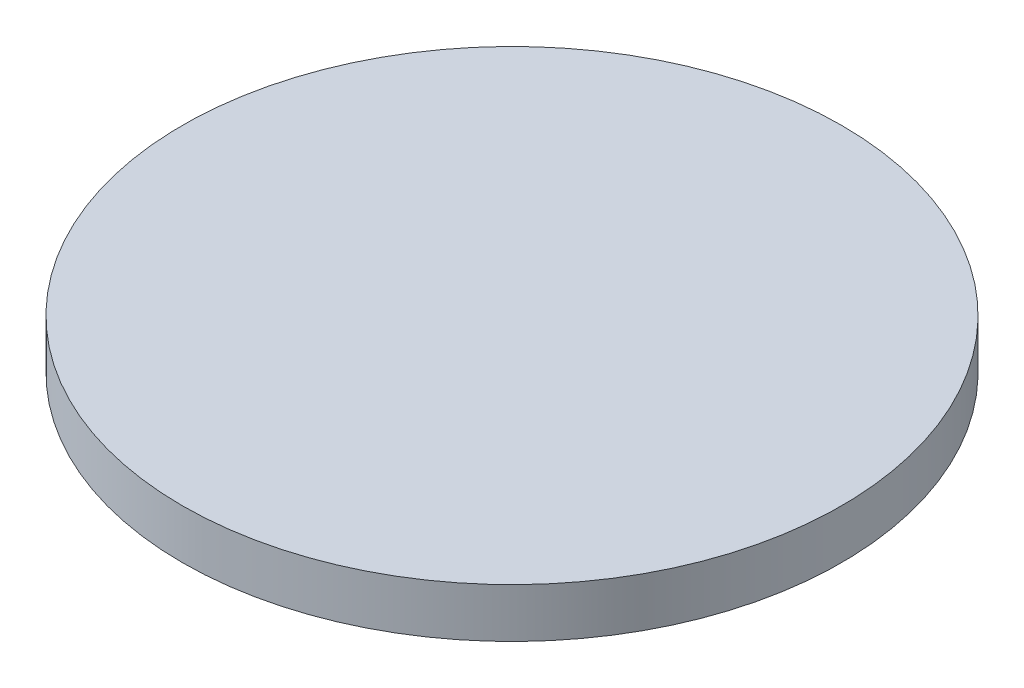
ISO-10303-21;
HEADER;
FILE_DESCRIPTION(('STEP AP214'),'2;1');
FILE_NAME('part.step','',(''),(''),'','','');
FILE_SCHEMA(('AUTOMOTIVE_DESIGN { 1 0 10303 214 1 1 1 1 }'));
ENDSEC;
DATA;
#1=APPLICATION_CONTEXT('core data for automotive mechanical design processes');
#2=APPLICATION_PROTOCOL_DEFINITION('international standard','automotive_design',2000,#1);
#3=PRODUCT_CONTEXT('',#1,'mechanical');
#4=PRODUCT('Part','Part','',(#3));
#5=PRODUCT_RELATED_PRODUCT_CATEGORY('part','',(#4));
#6=PRODUCT_DEFINITION_FORMATION('','',#4);
#7=PRODUCT_DEFINITION_CONTEXT('part definition',#1,'design');
#8=PRODUCT_DEFINITION('design','',#6,#7);
#9=PRODUCT_DEFINITION_SHAPE('','',#8);
#10=(LENGTH_UNIT() NAMED_UNIT(*) SI_UNIT(.MILLI.,.METRE.));
#11=(NAMED_UNIT(*) PLANE_ANGLE_UNIT() SI_UNIT($,.RADIAN.));
#12=(NAMED_UNIT(*) SI_UNIT($,.STERADIAN.) SOLID_ANGLE_UNIT());
#13=UNCERTAINTY_MEASURE_WITH_UNIT(LENGTH_MEASURE(1.E-05),#10,'distance_accuracy_value','');
#14=(GEOMETRIC_REPRESENTATION_CONTEXT(3) GLOBAL_UNCERTAINTY_ASSIGNED_CONTEXT((#13)) GLOBAL_UNIT_ASSIGNED_CONTEXT((#10,
#11,#12)) REPRESENTATION_CONTEXT('',''));
#15=CARTESIAN_POINT('',(0.,0.,0.));
#16=DIRECTION('',(0.,0.,1.));
#17=DIRECTION('',(1.,0.,0.));
#18=AXIS2_PLACEMENT_3D('',#15,#16,#17);
#19=CARTESIAN_POINT('',(0.,3.03784,0.));
#20=DIRECTION('',(0.,-1.,0.));
#21=DIRECTION('',(0.,0.,-1.));
#22=AXIS2_PLACEMENT_3D('',#19,#20,#21);
#23=CYLINDRICAL_SURFACE('',#22,20.32);
#24=CARTESIAN_POINT('',(0.,3.03784,0.));
#25=DIRECTION('',(0.,1.,0.));
#26=DIRECTION('',(0.,0.,1.));
#27=AXIS2_PLACEMENT_3D('',#24,#25,#26);
#28=CIRCLE('',#27,20.32);
#29=CARTESIAN_POINT('',(0.,3.03784,20.32));
#30=VERTEX_POINT('',#29);
#31=EDGE_CURVE('E10',#30,#30,#28,.T.);
#32=ORIENTED_EDGE('',*,*,#31,.F.);
#33=EDGE_LOOP('',(#32));
#34=FACE_BOUND('',#33,.T.);
#35=CARTESIAN_POINT('',(0.,0.,0.));
#36=DIRECTION('',(0.,1.,0.));
#37=DIRECTION('',(0.,0.,1.));
#38=AXIS2_PLACEMENT_3D('',#35,#36,#37);
#39=CIRCLE('',#38,20.32);
#40=CARTESIAN_POINT('',(0.,0.,20.32));
#41=VERTEX_POINT('',#40);
#42=EDGE_CURVE('E35',#41,#41,#39,.T.);
#43=ORIENTED_EDGE('',*,*,#42,.T.);
#44=EDGE_LOOP('',(#43));
#45=FACE_BOUND('',#44,.T.);
#46=ADVANCED_FACE('F32',(#34,#45),#23,.T.);
#47=CARTESIAN_POINT('',(0.,3.03784,0.));
#48=DIRECTION('',(0.,1.,0.));
#49=DIRECTION('',(0.,0.,1.));
#50=AXIS2_PLACEMENT_3D('',#47,#48,#49);
#51=PLANE('',#50);
#52=ORIENTED_EDGE('',*,*,#31,.T.);
#53=EDGE_LOOP('',(#52));
#54=FACE_BOUND('',#53,.T.);
#55=ADVANCED_FACE('F47',(#54),#51,.T.);
#56=CARTESIAN_POINT('',(0.,0.,0.));
#57=DIRECTION('',(0.,1.,0.));
#58=DIRECTION('',(0.,0.,1.));
#59=AXIS2_PLACEMENT_3D('',#56,#57,#58);
#60=PLANE('',#59);
#61=ORIENTED_EDGE('',*,*,#42,.F.);
#62=EDGE_LOOP('',(#61));
#63=FACE_BOUND('',#62,.T.);
#64=ADVANCED_FACE('F45',(#63),#60,.F.);
#65=CLOSED_SHELL('',(#46,#55,#64));
#66=MANIFOLD_SOLID_BREP('B2',#65);
#67=ADVANCED_BREP_SHAPE_REPRESENTATION('',(#18,#66),#14);
#68=SHAPE_DEFINITION_REPRESENTATION(#9,#67);
ENDSEC;
END-ISO-10303-21;
